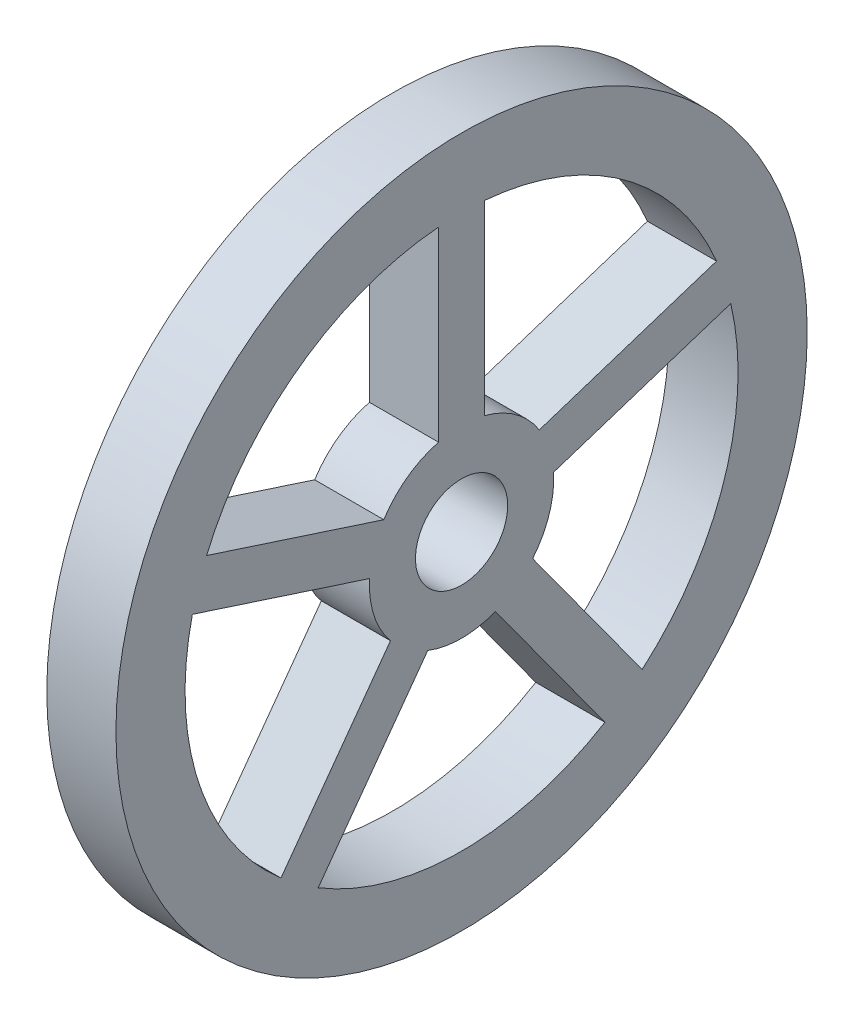
ISO-10303-21;
HEADER;
FILE_DESCRIPTION(('STEP AP214'),'2;1');
FILE_NAME('part.step','',(''),(''),'','','');
FILE_SCHEMA(('AUTOMOTIVE_DESIGN { 1 0 10303 214 1 1 1 1 }'));
ENDSEC;
DATA;
#1=APPLICATION_CONTEXT('core data for automotive mechanical design processes');
#2=APPLICATION_PROTOCOL_DEFINITION('international standard','automotive_design',2000,#1);
#3=PRODUCT_CONTEXT('',#1,'mechanical');
#4=PRODUCT('Part','Part','',(#3));
#5=PRODUCT_RELATED_PRODUCT_CATEGORY('part','',(#4));
#6=PRODUCT_DEFINITION_FORMATION('','',#4);
#7=PRODUCT_DEFINITION_CONTEXT('part definition',#1,'design');
#8=PRODUCT_DEFINITION('design','',#6,#7);
#9=PRODUCT_DEFINITION_SHAPE('','',#8);
#10=(LENGTH_UNIT() NAMED_UNIT(*) SI_UNIT(.MILLI.,.METRE.));
#11=(NAMED_UNIT(*) PLANE_ANGLE_UNIT() SI_UNIT($,.RADIAN.));
#12=(NAMED_UNIT(*) SI_UNIT($,.STERADIAN.) SOLID_ANGLE_UNIT());
#13=UNCERTAINTY_MEASURE_WITH_UNIT(LENGTH_MEASURE(1.E-05),#10,'distance_accuracy_value','');
#14=(GEOMETRIC_REPRESENTATION_CONTEXT(3) GLOBAL_UNCERTAINTY_ASSIGNED_CONTEXT((#13)) GLOBAL_UNIT_ASSIGNED_CONTEXT((#10,
#11,#12)) REPRESENTATION_CONTEXT('',''));
#15=CARTESIAN_POINT('',(0.,0.,0.));
#16=DIRECTION('',(0.,0.,1.));
#17=DIRECTION('',(1.,0.,0.));
#18=AXIS2_PLACEMENT_3D('',#15,#16,#17);
#19=CARTESIAN_POINT('',(30.,0.,0.));
#20=DIRECTION('',(1.,0.,0.));
#21=DIRECTION('',(0.,0.,-1.));
#22=AXIS2_PLACEMENT_3D('',#19,#20,#21);
#23=PLANE('',#22);
#24=CARTESIAN_POINT('',(30.,0.,0.));
#25=DIRECTION('',(1.,0.,0.));
#26=DIRECTION('',(0.,0.,-1.));
#27=AXIS2_PLACEMENT_3D('',#24,#25,#26);
#28=CIRCLE('',#27,150.);
#29=CARTESIAN_POINT('',(30.,0.,-150.));
#30=VERTEX_POINT('',#29);
#31=EDGE_CURVE('E11',#30,#30,#28,.T.);
#32=ORIENTED_EDGE('',*,*,#31,.T.);
#33=EDGE_LOOP('',(#32));
#34=FACE_BOUND('',#33,.T.);
#35=CARTESIAN_POINT('',(30.,0.,0.));
#36=DIRECTION('',(1.,0.,0.));
#37=DIRECTION('',(0.,0.,-1.));
#38=AXIS2_PLACEMENT_3D('',#35,#36,#37);
#39=CIRCLE('',#38,20.);
#40=CARTESIAN_POINT('',(30.,0.,-20.));
#41=VERTEX_POINT('',#40);
#42=EDGE_CURVE('E330',#41,#41,#39,.T.);
#43=ORIENTED_EDGE('',*,*,#42,.F.);
#44=EDGE_LOOP('',(#43));
#45=FACE_BOUND('',#44,.T.);
#46=DIRECTION('',(0.,-1.,0.));
#47=VECTOR('',#46,1.);
#48=CARTESIAN_POINT('',(30.,119.582607431014,-9.99999999999999));
#49=LINE('',#48,#47);
#50=CARTESIAN_POINT('',(30.,119.582607431014,-9.99999999999999));
#51=VERTEX_POINT('',#50);
#52=CARTESIAN_POINT('',(30.,38.7298334620742,-9.99999999999999));
#53=VERTEX_POINT('',#52);
#54=EDGE_CURVE('E301',#51,#53,#49,.T.);
#55=ORIENTED_EDGE('',*,*,#54,.F.);
#56=CARTESIAN_POINT('',(30.,0.,0.));
#57=DIRECTION('',(1.,0.,0.));
#58=DIRECTION('',(0.,0.,-1.));
#59=AXIS2_PLACEMENT_3D('',#56,#57,#58);
#60=CIRCLE('',#59,120.);
#61=CARTESIAN_POINT('',(30.,46.4636230908027,-110.639648089082));
#62=VERTEX_POINT('',#61);
#63=EDGE_CURVE('E299',#62,#51,#60,.T.);
#64=ORIENTED_EDGE('',*,*,#63,.F.);
#65=DIRECTION('',(0.,0.309016994374947,-0.951056516295154));
#66=VECTOR('',#65,1.);
#67=CARTESIAN_POINT('',(30.,46.4636230908027,-110.639648089082));
#68=LINE('',#67,#66);
#69=CARTESIAN_POINT('',(30.,21.478741892044,-33.7440905453822));
#70=VERTEX_POINT('',#69);
#71=EDGE_CURVE('E307',#70,#62,#68,.T.);
#72=ORIENTED_EDGE('',*,*,#71,.F.);
#73=CARTESIAN_POINT('',(30.,0.,0.));
#74=DIRECTION('',(-1.,0.,0.));
#75=DIRECTION('',(0.,0.,-1.));
#76=AXIS2_PLACEMENT_3D('',#73,#74,#75);
#77=CIRCLE('',#76,40.);
#78=EDGE_CURVE('E304',#53,#70,#77,.T.);
#79=ORIENTED_EDGE('',*,*,#78,.F.);
#80=EDGE_LOOP('',(#55,#64,#72,#79));
#81=FACE_BOUND('',#80,.T.);
#82=DIRECTION('',(0.,1.,0.));
#83=VECTOR('',#82,1.);
#84=CARTESIAN_POINT('',(30.,119.582607431014,10.));
#85=LINE('',#84,#83);
#86=CARTESIAN_POINT('',(30.,38.7298334620742,10.));
#87=VERTEX_POINT('',#86);
#88=CARTESIAN_POINT('',(30.,119.582607431014,10.));
#89=VERTEX_POINT('',#88);
#90=EDGE_CURVE('E270',#87,#89,#85,.T.);
#91=ORIENTED_EDGE('',*,*,#90,.F.);
#92=CARTESIAN_POINT('',(30.,0.,0.));
#93=DIRECTION('',(-1.,0.,0.));
#94=DIRECTION('',(0.,0.,-1.));
#95=AXIS2_PLACEMENT_3D('',#92,#93,#94);
#96=CIRCLE('',#95,40.);
#97=CARTESIAN_POINT('',(30.,21.4787418920439,33.7440905453823));
#98=VERTEX_POINT('',#97);
#99=EDGE_CURVE('E268',#98,#87,#96,.T.);
#100=ORIENTED_EDGE('',*,*,#99,.F.);
#101=DIRECTION('',(0.,-0.309016994374947,-0.951056516295154));
#102=VECTOR('',#101,1.);
#103=CARTESIAN_POINT('',(30.,46.4636230908027,110.639648089082));
#104=LINE('',#103,#102);
#105=CARTESIAN_POINT('',(30.,46.4636230908027,110.639648089082));
#106=VERTEX_POINT('',#105);
#107=EDGE_CURVE('E276',#106,#98,#104,.T.);
#108=ORIENTED_EDGE('',*,*,#107,.F.);
#109=CARTESIAN_POINT('',(30.,0.,0.));
#110=DIRECTION('',(1.,0.,0.));
#111=DIRECTION('',(0.,0.,-1.));
#112=AXIS2_PLACEMENT_3D('',#109,#110,#111);
#113=CIRCLE('',#112,120.);
#114=EDGE_CURVE('E273',#89,#106,#113,.T.);
#115=ORIENTED_EDGE('',*,*,#114,.F.);
#116=EDGE_LOOP('',(#91,#100,#108,#115));
#117=FACE_BOUND('',#116,.T.);
#118=DIRECTION('',(0.,-0.309016994374948,0.951056516295154));
#119=VECTOR('',#118,1.);
#120=CARTESIAN_POINT('',(30.,27.4424927648997,-116.819987976581));
#121=LINE('',#120,#119);
#122=CARTESIAN_POINT('',(30.,27.4424927648997,-116.819987976581));
#123=VERTEX_POINT('',#122);
#124=CARTESIAN_POINT('',(30.,2.4576115661409,-39.9244304328812));
#125=VERTEX_POINT('',#124);
#126=EDGE_CURVE('E239',#123,#125,#121,.T.);
#127=ORIENTED_EDGE('',*,*,#126,.F.);
#128=CARTESIAN_POINT('',(30.,0.,0.));
#129=DIRECTION('',(1.,0.,0.));
#130=DIRECTION('',(0.,0.,-1.));
#131=AXIS2_PLACEMENT_3D('',#128,#129,#130);
#132=CIRCLE('',#131,120.);
#133=CARTESIAN_POINT('',(30.,-90.8665091204334,-78.3790630223798));
#134=VERTEX_POINT('',#133);
#135=EDGE_CURVE('E237',#134,#123,#132,.T.);
#136=ORIENTED_EDGE('',*,*,#135,.F.);
#137=DIRECTION('',(0.,-0.809016994374947,-0.587785252292473));
#138=VECTOR('',#137,1.);
#139=CARTESIAN_POINT('',(30.,-90.8665091204334,-78.3790630223798));
#140=LINE('',#139,#138);
#141=CARTESIAN_POINT('',(30.,-25.4552409372048,-30.8549948765002));
#142=VERTEX_POINT('',#141);
#143=EDGE_CURVE('E245',#142,#134,#140,.T.);
#144=ORIENTED_EDGE('',*,*,#143,.F.);
#145=CARTESIAN_POINT('',(30.,0.,0.));
#146=DIRECTION('',(-1.,0.,0.));
#147=DIRECTION('',(0.,0.,-1.));
#148=AXIS2_PLACEMENT_3D('',#145,#146,#147);
#149=CIRCLE('',#148,40.);
#150=EDGE_CURVE('E242',#125,#142,#149,.T.);
#151=ORIENTED_EDGE('',*,*,#150,.F.);
#152=EDGE_LOOP('',(#127,#136,#144,#151));
#153=FACE_BOUND('',#152,.T.);
#154=DIRECTION('',(0.,0.809016994374947,0.587785252292473));
#155=VECTOR('',#154,1.);
#156=CARTESIAN_POINT('',(30.,-102.622214166283,-62.1987231348809));
#157=LINE('',#156,#155);
#158=CARTESIAN_POINT('',(30.,-102.622214166283,-62.1987231348809));
#159=VERTEX_POINT('',#158);
#160=CARTESIAN_POINT('',(30.,-37.2109459830542,-14.6746549890013));
#161=VERTEX_POINT('',#160);
#162=EDGE_CURVE('E208',#159,#161,#157,.T.);
#163=ORIENTED_EDGE('',*,*,#162,.F.);
#164=CARTESIAN_POINT('',(30.,0.,0.));
#165=DIRECTION('',(1.,0.,0.));
#166=DIRECTION('',(0.,0.,-1.));
#167=AXIS2_PLACEMENT_3D('',#164,#165,#166);
#168=CIRCLE('',#167,120.);
#169=CARTESIAN_POINT('',(30.,-102.622214166284,62.1987231348788));
#170=VERTEX_POINT('',#169);
#171=EDGE_CURVE('E206',#170,#159,#168,.T.);
#172=ORIENTED_EDGE('',*,*,#171,.F.);
#173=DIRECTION('',(0.,-0.809016994374965,0.587785252292449));
#174=VECTOR('',#173,1.);
#175=CARTESIAN_POINT('',(30.,-102.622214166284,62.1987231348788));
#176=LINE('',#175,#174);
#177=CARTESIAN_POINT('',(30.,-37.2109459830542,14.6746549890013));
#178=VERTEX_POINT('',#177);
#179=EDGE_CURVE('E214',#178,#170,#176,.T.);
#180=ORIENTED_EDGE('',*,*,#179,.F.);
#181=CARTESIAN_POINT('',(30.,0.,0.));
#182=DIRECTION('',(-1.,0.,0.));
#183=DIRECTION('',(0.,0.,-1.));
#184=AXIS2_PLACEMENT_3D('',#181,#182,#183);
#185=CIRCLE('',#184,40.);
#186=EDGE_CURVE('E211',#161,#178,#185,.T.);
#187=ORIENTED_EDGE('',*,*,#186,.F.);
#188=EDGE_LOOP('',(#163,#172,#180,#187));
#189=FACE_BOUND('',#188,.T.);
#190=DIRECTION('',(0.,0.809016994374947,-0.587785252292473));
#191=VECTOR('',#190,1.);
#192=CARTESIAN_POINT('',(30.,-90.8665091204335,78.3790630223798));
#193=LINE('',#192,#191);
#194=CARTESIAN_POINT('',(30.,-90.8665091204335,78.3790630223798));
#195=VERTEX_POINT('',#194);
#196=CARTESIAN_POINT('',(30.,-25.4552409372048,30.8549948765002));
#197=VERTEX_POINT('',#196);
#198=EDGE_CURVE('E178',#195,#197,#193,.T.);
#199=ORIENTED_EDGE('',*,*,#198,.F.);
#200=CARTESIAN_POINT('',(30.,0.,0.));
#201=DIRECTION('',(1.,0.,0.));
#202=DIRECTION('',(0.,0.,-1.));
#203=AXIS2_PLACEMENT_3D('',#200,#201,#202);
#204=CIRCLE('',#203,120.);
#205=CARTESIAN_POINT('',(30.,27.4424927648996,116.819987976581));
#206=VERTEX_POINT('',#205);
#207=EDGE_CURVE('E170',#206,#195,#204,.T.);
#208=ORIENTED_EDGE('',*,*,#207,.F.);
#209=DIRECTION('',(0.,0.309016994374947,0.951056516295154));
#210=VECTOR('',#209,1.);
#211=CARTESIAN_POINT('',(30.,27.4424927648996,116.819987976581));
#212=LINE('',#211,#210);
#213=CARTESIAN_POINT('',(30.,2.45761156614088,39.9244304328812));
#214=VERTEX_POINT('',#213);
#215=EDGE_CURVE('E192',#214,#206,#212,.T.);
#216=ORIENTED_EDGE('',*,*,#215,.F.);
#217=CARTESIAN_POINT('',(30.,0.,0.));
#218=DIRECTION('',(-1.,0.,0.));
#219=DIRECTION('',(0.,0.,-1.));
#220=AXIS2_PLACEMENT_3D('',#217,#218,#219);
#221=CIRCLE('',#220,40.);
#222=EDGE_CURVE('E190',#197,#214,#221,.T.);
#223=ORIENTED_EDGE('',*,*,#222,.F.);
#224=EDGE_LOOP('',(#199,#208,#216,#223));
#225=FACE_BOUND('',#224,.T.);
#226=ADVANCED_FACE('F33',(#34,#45,#81,#117,#153,#189,#225),#23,.T.);
#227=CARTESIAN_POINT('',(0.,0.,0.));
#228=DIRECTION('',(1.,0.,0.));
#229=DIRECTION('',(0.,0.,-1.));
#230=AXIS2_PLACEMENT_3D('',#227,#228,#229);
#231=PLANE('',#230);
#232=CARTESIAN_POINT('',(0.,0.,0.));
#233=DIRECTION('',(1.,0.,0.));
#234=DIRECTION('',(0.,0.,-1.));
#235=AXIS2_PLACEMENT_3D('',#232,#233,#234);
#236=CIRCLE('',#235,120.);
#237=CARTESIAN_POINT('',(0.,-102.622214166284,62.1987231348788));
#238=VERTEX_POINT('',#237);
#239=CARTESIAN_POINT('',(0.,-102.622214166283,-62.1987231348809));
#240=VERTEX_POINT('',#239);
#241=EDGE_CURVE('E186',#238,#240,#236,.T.);
#242=ORIENTED_EDGE('',*,*,#241,.T.);
#243=DIRECTION('',(0.,0.809016994374947,0.587785252292473));
#244=VECTOR('',#243,1.);
#245=CARTESIAN_POINT('',(0.,-102.622214166283,-62.1987231348809));
#246=LINE('',#245,#244);
#247=CARTESIAN_POINT('',(0.,-37.2109459830542,-14.6746549890013));
#248=VERTEX_POINT('',#247);
#249=EDGE_CURVE('E219',#240,#248,#246,.T.);
#250=ORIENTED_EDGE('',*,*,#249,.T.);
#251=CARTESIAN_POINT('',(0.,0.,0.));
#252=DIRECTION('',(-1.,0.,0.));
#253=DIRECTION('',(0.,0.,-1.));
#254=AXIS2_PLACEMENT_3D('',#251,#252,#253);
#255=CIRCLE('',#254,40.);
#256=CARTESIAN_POINT('',(0.,-37.2109459830542,14.6746549890013));
#257=VERTEX_POINT('',#256);
#258=EDGE_CURVE('E222',#248,#257,#255,.T.);
#259=ORIENTED_EDGE('',*,*,#258,.T.);
#260=DIRECTION('',(0.,-0.809016994374965,0.587785252292449));
#261=VECTOR('',#260,1.);
#262=CARTESIAN_POINT('',(0.,-102.622214166284,62.1987231348788));
#263=LINE('',#262,#261);
#264=EDGE_CURVE('E209',#257,#238,#263,.T.);
#265=ORIENTED_EDGE('',*,*,#264,.T.);
#266=EDGE_LOOP('',(#242,#250,#259,#265));
#267=FACE_BOUND('',#266,.T.);
#268=CARTESIAN_POINT('',(0.,0.,0.));
#269=DIRECTION('',(-1.,0.,0.));
#270=DIRECTION('',(0.,0.,-1.));
#271=AXIS2_PLACEMENT_3D('',#268,#269,#270);
#272=CIRCLE('',#271,40.);
#273=CARTESIAN_POINT('',(0.,21.4787418920439,33.7440905453823));
#274=VERTEX_POINT('',#273);
#275=CARTESIAN_POINT('',(0.,38.7298334620742,10.));
#276=VERTEX_POINT('',#275);
#277=EDGE_CURVE('E267',#274,#276,#272,.T.);
#278=ORIENTED_EDGE('',*,*,#277,.T.);
#279=DIRECTION('',(0.,1.,0.));
#280=VECTOR('',#279,1.);
#281=CARTESIAN_POINT('',(0.,119.582607431014,10.));
#282=LINE('',#281,#280);
#283=CARTESIAN_POINT('',(0.,119.582607431014,10.));
#284=VERTEX_POINT('',#283);
#285=EDGE_CURVE('E281',#276,#284,#282,.T.);
#286=ORIENTED_EDGE('',*,*,#285,.T.);
#287=CARTESIAN_POINT('',(0.,0.,0.));
#288=DIRECTION('',(1.,0.,0.));
#289=DIRECTION('',(0.,0.,-1.));
#290=AXIS2_PLACEMENT_3D('',#287,#288,#289);
#291=CIRCLE('',#290,120.);
#292=CARTESIAN_POINT('',(0.,46.4636230908027,110.639648089082));
#293=VERTEX_POINT('',#292);
#294=EDGE_CURVE('E284',#284,#293,#291,.T.);
#295=ORIENTED_EDGE('',*,*,#294,.T.);
#296=DIRECTION('',(0.,-0.309016994374947,-0.951056516295154));
#297=VECTOR('',#296,1.);
#298=CARTESIAN_POINT('',(0.,46.4636230908027,110.639648089082));
#299=LINE('',#298,#297);
#300=EDGE_CURVE('E271',#293,#274,#299,.T.);
#301=ORIENTED_EDGE('',*,*,#300,.T.);
#302=EDGE_LOOP('',(#278,#286,#295,#301));
#303=FACE_BOUND('',#302,.T.);
#304=CARTESIAN_POINT('',(0.,0.,0.));
#305=DIRECTION('',(1.,0.,0.));
#306=DIRECTION('',(0.,0.,-1.));
#307=AXIS2_PLACEMENT_3D('',#304,#305,#306);
#308=CIRCLE('',#307,20.);
#309=CARTESIAN_POINT('',(0.,0.,-20.));
#310=VERTEX_POINT('',#309);
#311=EDGE_CURVE('E329',#310,#310,#308,.T.);
#312=ORIENTED_EDGE('',*,*,#311,.T.);
#313=EDGE_LOOP('',(#312));
#314=FACE_BOUND('',#313,.T.);
#315=CARTESIAN_POINT('',(0.,0.,0.));
#316=DIRECTION('',(1.,0.,0.));
#317=DIRECTION('',(0.,0.,-1.));
#318=AXIS2_PLACEMENT_3D('',#315,#316,#317);
#319=CIRCLE('',#318,150.);
#320=CARTESIAN_POINT('',(0.,0.,-150.));
#321=VERTEX_POINT('',#320);
#322=EDGE_CURVE('E37',#321,#321,#319,.T.);
#323=ORIENTED_EDGE('',*,*,#322,.F.);
#324=EDGE_LOOP('',(#323));
#325=FACE_BOUND('',#324,.T.);
#326=CARTESIAN_POINT('',(0.,0.,0.));
#327=DIRECTION('',(1.,0.,0.));
#328=DIRECTION('',(0.,0.,-1.));
#329=AXIS2_PLACEMENT_3D('',#326,#327,#328);
#330=CIRCLE('',#329,120.);
#331=CARTESIAN_POINT('',(0.,46.4636230908027,-110.639648089082));
#332=VERTEX_POINT('',#331);
#333=CARTESIAN_POINT('',(0.,119.582607431014,-9.99999999999999));
#334=VERTEX_POINT('',#333);
#335=EDGE_CURVE('E298',#332,#334,#330,.T.);
#336=ORIENTED_EDGE('',*,*,#335,.T.);
#337=DIRECTION('',(0.,-1.,0.));
#338=VECTOR('',#337,1.);
#339=CARTESIAN_POINT('',(0.,119.582607431014,-9.99999999999999));
#340=LINE('',#339,#338);
#341=CARTESIAN_POINT('',(0.,38.7298334620742,-9.99999999999999));
#342=VERTEX_POINT('',#341);
#343=EDGE_CURVE('E312',#334,#342,#340,.T.);
#344=ORIENTED_EDGE('',*,*,#343,.T.);
#345=CARTESIAN_POINT('',(0.,0.,0.));
#346=DIRECTION('',(-1.,0.,0.));
#347=DIRECTION('',(0.,0.,-1.));
#348=AXIS2_PLACEMENT_3D('',#345,#346,#347);
#349=CIRCLE('',#348,40.);
#350=CARTESIAN_POINT('',(0.,21.478741892044,-33.7440905453822));
#351=VERTEX_POINT('',#350);
#352=EDGE_CURVE('E315',#342,#351,#349,.T.);
#353=ORIENTED_EDGE('',*,*,#352,.T.);
#354=DIRECTION('',(0.,0.309016994374947,-0.951056516295154));
#355=VECTOR('',#354,1.);
#356=CARTESIAN_POINT('',(0.,46.4636230908027,-110.639648089082));
#357=LINE('',#356,#355);
#358=EDGE_CURVE('E302',#351,#332,#357,.T.);
#359=ORIENTED_EDGE('',*,*,#358,.T.);
#360=EDGE_LOOP('',(#336,#344,#353,#359));
#361=FACE_BOUND('',#360,.T.);
#362=CARTESIAN_POINT('',(0.,0.,0.));
#363=DIRECTION('',(1.,0.,0.));
#364=DIRECTION('',(0.,0.,-1.));
#365=AXIS2_PLACEMENT_3D('',#362,#363,#364);
#366=CIRCLE('',#365,120.);
#367=CARTESIAN_POINT('',(0.,-90.8665091204334,-78.3790630223798));
#368=VERTEX_POINT('',#367);
#369=CARTESIAN_POINT('',(0.,27.4424927648997,-116.819987976581));
#370=VERTEX_POINT('',#369);
#371=EDGE_CURVE('E236',#368,#370,#366,.T.);
#372=ORIENTED_EDGE('',*,*,#371,.T.);
#373=DIRECTION('',(0.,-0.309016994374948,0.951056516295154));
#374=VECTOR('',#373,1.);
#375=CARTESIAN_POINT('',(0.,27.4424927648997,-116.819987976581));
#376=LINE('',#375,#374);
#377=CARTESIAN_POINT('',(0.,2.4576115661409,-39.9244304328812));
#378=VERTEX_POINT('',#377);
#379=EDGE_CURVE('E250',#370,#378,#376,.T.);
#380=ORIENTED_EDGE('',*,*,#379,.T.);
#381=CARTESIAN_POINT('',(0.,0.,0.));
#382=DIRECTION('',(-1.,0.,0.));
#383=DIRECTION('',(0.,0.,-1.));
#384=AXIS2_PLACEMENT_3D('',#381,#382,#383);
#385=CIRCLE('',#384,40.);
#386=CARTESIAN_POINT('',(0.,-25.4552409372048,-30.8549948765002));
#387=VERTEX_POINT('',#386);
#388=EDGE_CURVE('E253',#378,#387,#385,.T.);
#389=ORIENTED_EDGE('',*,*,#388,.T.);
#390=DIRECTION('',(0.,-0.809016994374947,-0.587785252292473));
#391=VECTOR('',#390,1.);
#392=CARTESIAN_POINT('',(0.,-90.8665091204334,-78.3790630223798));
#393=LINE('',#392,#391);
#394=EDGE_CURVE('E240',#387,#368,#393,.T.);
#395=ORIENTED_EDGE('',*,*,#394,.T.);
#396=EDGE_LOOP('',(#372,#380,#389,#395));
#397=FACE_BOUND('',#396,.T.);
#398=CARTESIAN_POINT('',(0.,0.,0.));
#399=DIRECTION('',(1.,0.,0.));
#400=DIRECTION('',(0.,0.,-1.));
#401=AXIS2_PLACEMENT_3D('',#398,#399,#400);
#402=CIRCLE('',#401,120.);
#403=CARTESIAN_POINT('',(0.,27.4424927648996,116.819987976581));
#404=VERTEX_POINT('',#403);
#405=CARTESIAN_POINT('',(0.,-90.8665091204335,78.3790630223798));
#406=VERTEX_POINT('',#405);
#407=EDGE_CURVE('E56',#404,#406,#402,.T.);
#408=ORIENTED_EDGE('',*,*,#407,.T.);
#409=DIRECTION('',(0.,0.809016994374947,-0.587785252292473));
#410=VECTOR('',#409,1.);
#411=CARTESIAN_POINT('',(0.,-90.8665091204335,78.3790630223798));
#412=LINE('',#411,#410);
#413=CARTESIAN_POINT('',(0.,-25.4552409372048,30.8549948765002));
#414=VERTEX_POINT('',#413);
#415=EDGE_CURVE('E185',#406,#414,#412,.T.);
#416=ORIENTED_EDGE('',*,*,#415,.T.);
#417=CARTESIAN_POINT('',(0.,0.,0.));
#418=DIRECTION('',(-1.,0.,0.));
#419=DIRECTION('',(0.,0.,-1.));
#420=AXIS2_PLACEMENT_3D('',#417,#418,#419);
#421=CIRCLE('',#420,40.);
#422=CARTESIAN_POINT('',(0.,2.45761156614087,39.9244304328812));
#423=VERTEX_POINT('',#422);
#424=EDGE_CURVE('E198',#414,#423,#421,.T.);
#425=ORIENTED_EDGE('',*,*,#424,.T.);
#426=DIRECTION('',(0.,0.309016994374947,0.951056516295154));
#427=VECTOR('',#426,1.);
#428=CARTESIAN_POINT('',(0.,27.4424927648996,116.819987976581));
#429=LINE('',#428,#427);
#430=EDGE_CURVE('E179',#423,#404,#429,.T.);
#431=ORIENTED_EDGE('',*,*,#430,.T.);
#432=EDGE_LOOP('',(#408,#416,#425,#431));
#433=FACE_BOUND('',#432,.T.);
#434=ADVANCED_FACE('F336',(#267,#303,#314,#325,#361,#397,#433),#231,.F.);
#435=CARTESIAN_POINT('',(30.,0.,0.));
#436=DIRECTION('',(-1.,0.,0.));
#437=DIRECTION('',(0.,0.,1.));
#438=AXIS2_PLACEMENT_3D('',#435,#436,#437);
#439=CYLINDRICAL_SURFACE('',#438,150.);
#440=ORIENTED_EDGE('',*,*,#31,.F.);
#441=EDGE_LOOP('',(#440));
#442=FACE_BOUND('',#441,.T.);
#443=ORIENTED_EDGE('',*,*,#322,.T.);
#444=EDGE_LOOP('',(#443));
#445=FACE_BOUND('',#444,.T.);
#446=ADVANCED_FACE('F35',(#442,#445),#439,.T.);
#447=CARTESIAN_POINT('',(30.,0.,0.));
#448=DIRECTION('',(-1.,0.,0.));
#449=DIRECTION('',(0.,0.,1.));
#450=AXIS2_PLACEMENT_3D('',#447,#448,#449);
#451=CYLINDRICAL_SURFACE('',#450,20.);
#452=ORIENTED_EDGE('',*,*,#42,.T.);
#453=EDGE_LOOP('',(#452));
#454=FACE_BOUND('',#453,.T.);
#455=ORIENTED_EDGE('',*,*,#311,.F.);
#456=EDGE_LOOP('',(#455));
#457=FACE_BOUND('',#456,.T.);
#458=ADVANCED_FACE('F339',(#454,#457),#451,.F.);
#459=CARTESIAN_POINT('',(30.,0.,0.));
#460=DIRECTION('',(-1.,0.,0.));
#461=DIRECTION('',(0.,0.,1.));
#462=AXIS2_PLACEMENT_3D('',#459,#460,#461);
#463=CYLINDRICAL_SURFACE('',#462,120.);
#464=ORIENTED_EDGE('',*,*,#335,.F.);
#465=DIRECTION('',(-1.,0.,0.));
#466=VECTOR('',#465,1.);
#467=CARTESIAN_POINT('',(30.,46.4636230908027,-110.639648089082));
#468=LINE('',#467,#466);
#469=EDGE_CURVE('E309',#62,#332,#468,.T.);
#470=ORIENTED_EDGE('',*,*,#469,.F.);
#471=ORIENTED_EDGE('',*,*,#63,.T.);
#472=DIRECTION('',(-1.,0.,0.));
#473=VECTOR('',#472,1.);
#474=CARTESIAN_POINT('',(30.,119.582607431014,-9.99999999999999));
#475=LINE('',#474,#473);
#476=EDGE_CURVE('E326',#51,#334,#475,.T.);
#477=ORIENTED_EDGE('',*,*,#476,.T.);
#478=EDGE_LOOP('',(#464,#470,#471,#477));
#479=FACE_BOUND('',#478,.T.);
#480=ADVANCED_FACE('F341',(#479),#463,.F.);
#481=CARTESIAN_POINT('',(30.,119.582607431014,-9.99999999999999));
#482=DIRECTION('',(0.,0.,-1.));
#483=DIRECTION('',(0.,1.,0.));
#484=AXIS2_PLACEMENT_3D('',#481,#482,#483);
#485=PLANE('',#484);
#486=ORIENTED_EDGE('',*,*,#343,.F.);
#487=ORIENTED_EDGE('',*,*,#476,.F.);
#488=ORIENTED_EDGE('',*,*,#54,.T.);
#489=DIRECTION('',(-1.,0.,0.));
#490=VECTOR('',#489,1.);
#491=CARTESIAN_POINT('',(30.,38.7298334620742,-9.99999999999999));
#492=LINE('',#491,#490);
#493=EDGE_CURVE('E324',#53,#342,#492,.T.);
#494=ORIENTED_EDGE('',*,*,#493,.T.);
#495=EDGE_LOOP('',(#486,#487,#488,#494));
#496=FACE_BOUND('',#495,.T.);
#497=ADVANCED_FACE('F348',(#496),#485,.T.);
#498=CARTESIAN_POINT('',(30.,0.,0.));
#499=DIRECTION('',(-1.,0.,0.));
#500=DIRECTION('',(0.,0.,1.));
#501=AXIS2_PLACEMENT_3D('',#498,#499,#500);
#502=CYLINDRICAL_SURFACE('',#501,40.);
#503=ORIENTED_EDGE('',*,*,#352,.F.);
#504=ORIENTED_EDGE('',*,*,#493,.F.);
#505=ORIENTED_EDGE('',*,*,#78,.T.);
#506=DIRECTION('',(-1.,0.,0.));
#507=VECTOR('',#506,1.);
#508=CARTESIAN_POINT('',(30.,21.478741892044,-33.7440905453822));
#509=LINE('',#508,#507);
#510=EDGE_CURVE('E322',#70,#351,#509,.T.);
#511=ORIENTED_EDGE('',*,*,#510,.T.);
#512=EDGE_LOOP('',(#503,#504,#505,#511));
#513=FACE_BOUND('',#512,.T.);
#514=ADVANCED_FACE('F442',(#513),#502,.T.);
#515=CARTESIAN_POINT('',(30.,46.4636230908027,-110.639648089082));
#516=DIRECTION('',(0.,0.951056516295154,0.309016994374947));
#517=DIRECTION('',(0.,-0.309016994374947,0.951056516295154));
#518=AXIS2_PLACEMENT_3D('',#515,#516,#517);
#519=PLANE('',#518);
#520=ORIENTED_EDGE('',*,*,#358,.F.);
#521=ORIENTED_EDGE('',*,*,#510,.F.);
#522=ORIENTED_EDGE('',*,*,#71,.T.);
#523=ORIENTED_EDGE('',*,*,#469,.T.);
#524=EDGE_LOOP('',(#520,#521,#522,#523));
#525=FACE_BOUND('',#524,.T.);
#526=ADVANCED_FACE('F438',(#525),#519,.T.);
#527=CARTESIAN_POINT('',(30.,0.,0.));
#528=DIRECTION('',(-1.,0.,0.));
#529=DIRECTION('',(0.,0.,1.));
#530=AXIS2_PLACEMENT_3D('',#527,#528,#529);
#531=CYLINDRICAL_SURFACE('',#530,40.);
#532=ORIENTED_EDGE('',*,*,#277,.F.);
#533=DIRECTION('',(-1.,0.,0.));
#534=VECTOR('',#533,1.);
#535=CARTESIAN_POINT('',(30.,21.4787418920439,33.7440905453823));
#536=LINE('',#535,#534);
#537=EDGE_CURVE('E278',#98,#274,#536,.T.);
#538=ORIENTED_EDGE('',*,*,#537,.F.);
#539=ORIENTED_EDGE('',*,*,#99,.T.);
#540=DIRECTION('',(-1.,0.,0.));
#541=VECTOR('',#540,1.);
#542=CARTESIAN_POINT('',(30.,38.7298334620742,10.));
#543=LINE('',#542,#541);
#544=EDGE_CURVE('E295',#87,#276,#543,.T.);
#545=ORIENTED_EDGE('',*,*,#544,.T.);
#546=EDGE_LOOP('',(#532,#538,#539,#545));
#547=FACE_BOUND('',#546,.T.);
#548=ADVANCED_FACE('F434',(#547),#531,.T.);
#549=CARTESIAN_POINT('',(30.,119.582607431014,10.));
#550=DIRECTION('',(0.,0.,1.));
#551=DIRECTION('',(0.,-1.,0.));
#552=AXIS2_PLACEMENT_3D('',#549,#550,#551);
#553=PLANE('',#552);
#554=ORIENTED_EDGE('',*,*,#285,.F.);
#555=ORIENTED_EDGE('',*,*,#544,.F.);
#556=ORIENTED_EDGE('',*,*,#90,.T.);
#557=DIRECTION('',(-1.,0.,0.));
#558=VECTOR('',#557,1.);
#559=CARTESIAN_POINT('',(30.,119.582607431014,10.));
#560=LINE('',#559,#558);
#561=EDGE_CURVE('E293',#89,#284,#560,.T.);
#562=ORIENTED_EDGE('',*,*,#561,.T.);
#563=EDGE_LOOP('',(#554,#555,#556,#562));
#564=FACE_BOUND('',#563,.T.);
#565=ADVANCED_FACE('F430',(#564),#553,.T.);
#566=CARTESIAN_POINT('',(30.,0.,0.));
#567=DIRECTION('',(-1.,0.,0.));
#568=DIRECTION('',(0.,0.,1.));
#569=AXIS2_PLACEMENT_3D('',#566,#567,#568);
#570=CYLINDRICAL_SURFACE('',#569,120.);
#571=ORIENTED_EDGE('',*,*,#294,.F.);
#572=ORIENTED_EDGE('',*,*,#561,.F.);
#573=ORIENTED_EDGE('',*,*,#114,.T.);
#574=DIRECTION('',(-1.,0.,0.));
#575=VECTOR('',#574,1.);
#576=CARTESIAN_POINT('',(30.,46.4636230908027,110.639648089082));
#577=LINE('',#576,#575);
#578=EDGE_CURVE('E291',#106,#293,#577,.T.);
#579=ORIENTED_EDGE('',*,*,#578,.T.);
#580=EDGE_LOOP('',(#571,#572,#573,#579));
#581=FACE_BOUND('',#580,.T.);
#582=ADVANCED_FACE('F426',(#581),#570,.F.);
#583=CARTESIAN_POINT('',(30.,46.4636230908027,110.639648089082));
#584=DIRECTION('',(0.,0.951056516295154,-0.309016994374947));
#585=DIRECTION('',(0.,0.309016994374947,0.951056516295154));
#586=AXIS2_PLACEMENT_3D('',#583,#584,#585);
#587=PLANE('',#586);
#588=ORIENTED_EDGE('',*,*,#300,.F.);
#589=ORIENTED_EDGE('',*,*,#578,.F.);
#590=ORIENTED_EDGE('',*,*,#107,.T.);
#591=ORIENTED_EDGE('',*,*,#537,.T.);
#592=EDGE_LOOP('',(#588,#589,#590,#591));
#593=FACE_BOUND('',#592,.T.);
#594=ADVANCED_FACE('F422',(#593),#587,.T.);
#595=CARTESIAN_POINT('',(30.,0.,0.));
#596=DIRECTION('',(-1.,0.,0.));
#597=DIRECTION('',(0.,0.,1.));
#598=AXIS2_PLACEMENT_3D('',#595,#596,#597);
#599=CYLINDRICAL_SURFACE('',#598,120.);
#600=ORIENTED_EDGE('',*,*,#371,.F.);
#601=DIRECTION('',(-1.,0.,0.));
#602=VECTOR('',#601,1.);
#603=CARTESIAN_POINT('',(30.,-90.8665091204334,-78.3790630223798));
#604=LINE('',#603,#602);
#605=EDGE_CURVE('E247',#134,#368,#604,.T.);
#606=ORIENTED_EDGE('',*,*,#605,.F.);
#607=ORIENTED_EDGE('',*,*,#135,.T.);
#608=DIRECTION('',(-1.,0.,0.));
#609=VECTOR('',#608,1.);
#610=CARTESIAN_POINT('',(30.,27.4424927648997,-116.819987976581));
#611=LINE('',#610,#609);
#612=EDGE_CURVE('E264',#123,#370,#611,.T.);
#613=ORIENTED_EDGE('',*,*,#612,.T.);
#614=EDGE_LOOP('',(#600,#606,#607,#613));
#615=FACE_BOUND('',#614,.T.);
#616=ADVANCED_FACE('F418',(#615),#599,.F.);
#617=CARTESIAN_POINT('',(30.,27.4424927648997,-116.819987976581));
#618=DIRECTION('',(0.,-0.951056516295154,-0.309016994374948));
#619=DIRECTION('',(0.,0.309016994374948,-0.951056516295154));
#620=AXIS2_PLACEMENT_3D('',#617,#618,#619);
#621=PLANE('',#620);
#622=ORIENTED_EDGE('',*,*,#379,.F.);
#623=ORIENTED_EDGE('',*,*,#612,.F.);
#624=ORIENTED_EDGE('',*,*,#126,.T.);
#625=DIRECTION('',(-1.,0.,0.));
#626=VECTOR('',#625,1.);
#627=CARTESIAN_POINT('',(30.,2.4576115661409,-39.9244304328812));
#628=LINE('',#627,#626);
#629=EDGE_CURVE('E262',#125,#378,#628,.T.);
#630=ORIENTED_EDGE('',*,*,#629,.T.);
#631=EDGE_LOOP('',(#622,#623,#624,#630));
#632=FACE_BOUND('',#631,.T.);
#633=ADVANCED_FACE('F414',(#632),#621,.T.);
#634=CARTESIAN_POINT('',(30.,0.,0.));
#635=DIRECTION('',(-1.,0.,0.));
#636=DIRECTION('',(0.,0.,1.));
#637=AXIS2_PLACEMENT_3D('',#634,#635,#636);
#638=CYLINDRICAL_SURFACE('',#637,40.);
#639=ORIENTED_EDGE('',*,*,#388,.F.);
#640=ORIENTED_EDGE('',*,*,#629,.F.);
#641=ORIENTED_EDGE('',*,*,#150,.T.);
#642=DIRECTION('',(-1.,0.,0.));
#643=VECTOR('',#642,1.);
#644=CARTESIAN_POINT('',(30.,-25.4552409372048,-30.8549948765002));
#645=LINE('',#644,#643);
#646=EDGE_CURVE('E260',#142,#387,#645,.T.);
#647=ORIENTED_EDGE('',*,*,#646,.T.);
#648=EDGE_LOOP('',(#639,#640,#641,#647));
#649=FACE_BOUND('',#648,.T.);
#650=ADVANCED_FACE('F410',(#649),#638,.T.);
#651=CARTESIAN_POINT('',(30.,-90.8665091204334,-78.3790630223798));
#652=DIRECTION('',(0.,0.587785252292473,-0.809016994374947));
#653=DIRECTION('',(0.,0.809016994374948,0.587785252292473));
#654=AXIS2_PLACEMENT_3D('',#651,#652,#653);
#655=PLANE('',#654);
#656=ORIENTED_EDGE('',*,*,#394,.F.);
#657=ORIENTED_EDGE('',*,*,#646,.F.);
#658=ORIENTED_EDGE('',*,*,#143,.T.);
#659=ORIENTED_EDGE('',*,*,#605,.T.);
#660=EDGE_LOOP('',(#656,#657,#658,#659));
#661=FACE_BOUND('',#660,.T.);
#662=ADVANCED_FACE('F407',(#661),#655,.T.);
#663=CARTESIAN_POINT('',(30.,0.,0.));
#664=DIRECTION('',(-1.,0.,0.));
#665=DIRECTION('',(0.,0.,1.));
#666=AXIS2_PLACEMENT_3D('',#663,#664,#665);
#667=CYLINDRICAL_SURFACE('',#666,120.);
#668=ORIENTED_EDGE('',*,*,#241,.F.);
#669=DIRECTION('',(-1.,0.,0.));
#670=VECTOR('',#669,1.);
#671=CARTESIAN_POINT('',(30.,-102.622214166284,62.1987231348788));
#672=LINE('',#671,#670);
#673=EDGE_CURVE('E216',#170,#238,#672,.T.);
#674=ORIENTED_EDGE('',*,*,#673,.F.);
#675=ORIENTED_EDGE('',*,*,#171,.T.);
#676=DIRECTION('',(-1.,0.,0.));
#677=VECTOR('',#676,1.);
#678=CARTESIAN_POINT('',(30.,-102.622214166283,-62.1987231348809));
#679=LINE('',#678,#677);
#680=EDGE_CURVE('E233',#159,#240,#679,.T.);
#681=ORIENTED_EDGE('',*,*,#680,.T.);
#682=EDGE_LOOP('',(#668,#674,#675,#681));
#683=FACE_BOUND('',#682,.T.);
#684=ADVANCED_FACE('F389',(#683),#667,.F.);
#685=CARTESIAN_POINT('',(30.,-102.622214166283,-62.1987231348809));
#686=DIRECTION('',(0.,-0.587785252292473,0.809016994374947));
#687=DIRECTION('',(0.,-0.809016994374947,-0.587785252292473));
#688=AXIS2_PLACEMENT_3D('',#685,#686,#687);
#689=PLANE('',#688);
#690=ORIENTED_EDGE('',*,*,#249,.F.);
#691=ORIENTED_EDGE('',*,*,#680,.F.);
#692=ORIENTED_EDGE('',*,*,#162,.T.);
#693=DIRECTION('',(-1.,0.,0.));
#694=VECTOR('',#693,1.);
#695=CARTESIAN_POINT('',(30.,-37.2109459830542,-14.6746549890013));
#696=LINE('',#695,#694);
#697=EDGE_CURVE('E231',#161,#248,#696,.T.);
#698=ORIENTED_EDGE('',*,*,#697,.T.);
#699=EDGE_LOOP('',(#690,#691,#692,#698));
#700=FACE_BOUND('',#699,.T.);
#701=ADVANCED_FACE('F382',(#700),#689,.T.);
#702=CARTESIAN_POINT('',(30.,0.,0.));
#703=DIRECTION('',(-1.,0.,0.));
#704=DIRECTION('',(0.,0.,1.));
#705=AXIS2_PLACEMENT_3D('',#702,#703,#704);
#706=CYLINDRICAL_SURFACE('',#705,40.);
#707=ORIENTED_EDGE('',*,*,#258,.F.);
#708=ORIENTED_EDGE('',*,*,#697,.F.);
#709=ORIENTED_EDGE('',*,*,#186,.T.);
#710=DIRECTION('',(-1.,0.,0.));
#711=VECTOR('',#710,1.);
#712=CARTESIAN_POINT('',(30.,-37.2109459830542,14.6746549890013));
#713=LINE('',#712,#711);
#714=EDGE_CURVE('E229',#178,#257,#713,.T.);
#715=ORIENTED_EDGE('',*,*,#714,.T.);
#716=EDGE_LOOP('',(#707,#708,#709,#715));
#717=FACE_BOUND('',#716,.T.);
#718=ADVANCED_FACE('F385',(#717),#706,.T.);
#719=CARTESIAN_POINT('',(30.,-102.622214166284,62.1987231348788));
#720=DIRECTION('',(0.,-0.587785252292449,-0.809016994374965));
#721=DIRECTION('',(0.,0.809016994374965,-0.587785252292449));
#722=AXIS2_PLACEMENT_3D('',#719,#720,#721);
#723=PLANE('',#722);
#724=ORIENTED_EDGE('',*,*,#264,.F.);
#725=ORIENTED_EDGE('',*,*,#714,.F.);
#726=ORIENTED_EDGE('',*,*,#179,.T.);
#727=ORIENTED_EDGE('',*,*,#673,.T.);
#728=EDGE_LOOP('',(#724,#725,#726,#727));
#729=FACE_BOUND('',#728,.T.);
#730=ADVANCED_FACE('F392',(#729),#723,.T.);
#731=CARTESIAN_POINT('',(30.,0.,0.));
#732=DIRECTION('',(-1.,0.,0.));
#733=DIRECTION('',(0.,0.,1.));
#734=AXIS2_PLACEMENT_3D('',#731,#732,#733);
#735=CYLINDRICAL_SURFACE('',#734,120.);
#736=ORIENTED_EDGE('',*,*,#407,.F.);
#737=DIRECTION('',(-1.,0.,0.));
#738=VECTOR('',#737,1.);
#739=CARTESIAN_POINT('',(30.,27.4424927648996,116.819987976581));
#740=LINE('',#739,#738);
#741=EDGE_CURVE('E174',#206,#404,#740,.T.);
#742=ORIENTED_EDGE('',*,*,#741,.F.);
#743=ORIENTED_EDGE('',*,*,#207,.T.);
#744=DIRECTION('',(-1.,0.,0.));
#745=VECTOR('',#744,1.);
#746=CARTESIAN_POINT('',(30.,-90.8665091204335,78.3790630223798));
#747=LINE('',#746,#745);
#748=EDGE_CURVE('E173',#195,#406,#747,.T.);
#749=ORIENTED_EDGE('',*,*,#748,.T.);
#750=EDGE_LOOP('',(#736,#742,#743,#749));
#751=FACE_BOUND('',#750,.T.);
#752=ADVANCED_FACE('F172',(#751),#735,.F.);
#753=CARTESIAN_POINT('',(30.,-90.8665091204335,78.3790630223798));
#754=DIRECTION('',(0.,0.587785252292473,0.809016994374947));
#755=DIRECTION('',(0.,-0.809016994374948,0.587785252292473));
#756=AXIS2_PLACEMENT_3D('',#753,#754,#755);
#757=PLANE('',#756);
#758=ORIENTED_EDGE('',*,*,#415,.F.);
#759=ORIENTED_EDGE('',*,*,#748,.F.);
#760=ORIENTED_EDGE('',*,*,#198,.T.);
#761=DIRECTION('',(-1.,0.,0.));
#762=VECTOR('',#761,1.);
#763=CARTESIAN_POINT('',(30.,-25.4552409372048,30.8549948765002));
#764=LINE('',#763,#762);
#765=EDGE_CURVE('E187',#197,#414,#764,.T.);
#766=ORIENTED_EDGE('',*,*,#765,.T.);
#767=EDGE_LOOP('',(#758,#759,#760,#766));
#768=FACE_BOUND('',#767,.T.);
#769=ADVANCED_FACE('F182',(#768),#757,.T.);
#770=CARTESIAN_POINT('',(30.,0.,0.));
#771=DIRECTION('',(-1.,0.,0.));
#772=DIRECTION('',(0.,0.,1.));
#773=AXIS2_PLACEMENT_3D('',#770,#771,#772);
#774=CYLINDRICAL_SURFACE('',#773,40.);
#775=ORIENTED_EDGE('',*,*,#424,.F.);
#776=ORIENTED_EDGE('',*,*,#765,.F.);
#777=ORIENTED_EDGE('',*,*,#222,.T.);
#778=DIRECTION('',(-1.,0.,0.));
#779=VECTOR('',#778,1.);
#780=CARTESIAN_POINT('',(30.,2.45761156614087,39.9244304328812));
#781=LINE('',#780,#779);
#782=EDGE_CURVE('E48',#214,#423,#781,.T.);
#783=ORIENTED_EDGE('',*,*,#782,.T.);
#784=EDGE_LOOP('',(#775,#776,#777,#783));
#785=FACE_BOUND('',#784,.T.);
#786=ADVANCED_FACE('F463',(#785),#774,.T.);
#787=CARTESIAN_POINT('',(30.,27.4424927648996,116.819987976581));
#788=DIRECTION('',(0.,-0.951056516295154,0.309016994374947));
#789=DIRECTION('',(0.,-0.309016994374948,-0.951056516295154));
#790=AXIS2_PLACEMENT_3D('',#787,#788,#789);
#791=PLANE('',#790);
#792=ORIENTED_EDGE('',*,*,#430,.F.);
#793=ORIENTED_EDGE('',*,*,#782,.F.);
#794=ORIENTED_EDGE('',*,*,#215,.T.);
#795=ORIENTED_EDGE('',*,*,#741,.T.);
#796=EDGE_LOOP('',(#792,#793,#794,#795));
#797=FACE_BOUND('',#796,.T.);
#798=ADVANCED_FACE('F461',(#797),#791,.T.);
#799=CLOSED_SHELL('',(#226,#434,#446,#458,#480,#497,#514,#526,#548,#565,#582,#594,#616,#633,
#650,#662,#684,#701,#718,#730,#752,#769,#786,#798));
#800=MANIFOLD_SOLID_BREP('B2',#799);
#801=ADVANCED_BREP_SHAPE_REPRESENTATION('',(#18,#800),#14);
#802=SHAPE_DEFINITION_REPRESENTATION(#9,#801);
ENDSEC;
END-ISO-10303-21;
